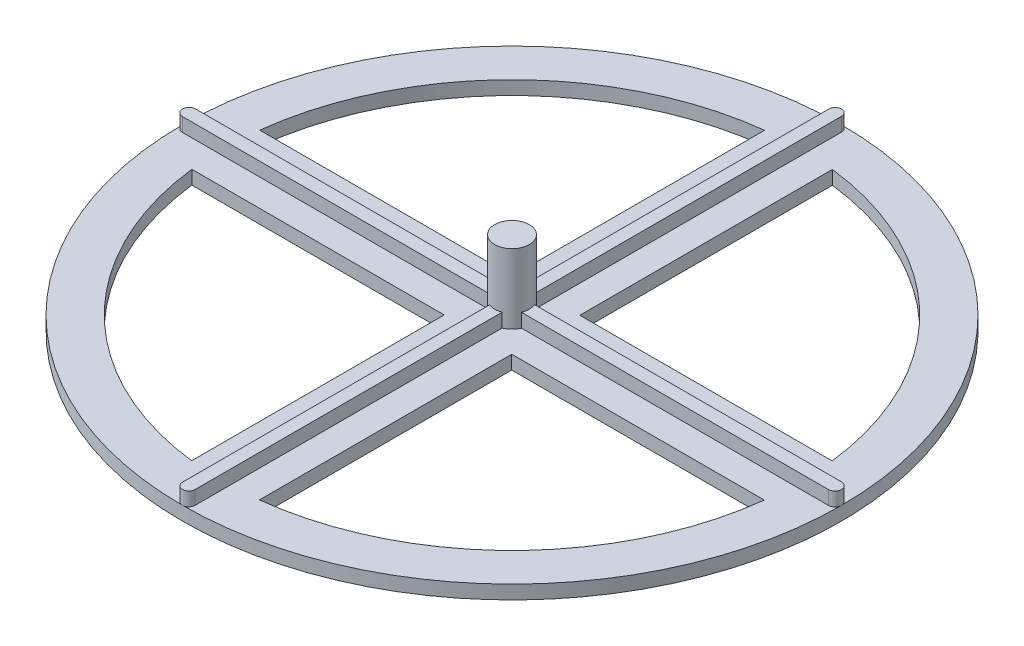
ISO-10303-21;
HEADER;
FILE_DESCRIPTION(('STEP AP214'),'2;1');
FILE_NAME('part.step','',(''),(''),'','','');
FILE_SCHEMA(('AUTOMOTIVE_DESIGN { 1 0 10303 214 1 1 1 1 }'));
ENDSEC;
DATA;
#1=APPLICATION_CONTEXT('core data for automotive mechanical design processes');
#2=APPLICATION_PROTOCOL_DEFINITION('international standard','automotive_design',2000,#1);
#3=PRODUCT_CONTEXT('',#1,'mechanical');
#4=PRODUCT('Part','Part','',(#3));
#5=PRODUCT_RELATED_PRODUCT_CATEGORY('part','',(#4));
#6=PRODUCT_DEFINITION_FORMATION('','',#4);
#7=PRODUCT_DEFINITION_CONTEXT('part definition',#1,'design');
#8=PRODUCT_DEFINITION('design','',#6,#7);
#9=PRODUCT_DEFINITION_SHAPE('','',#8);
#10=(LENGTH_UNIT() NAMED_UNIT(*) SI_UNIT(.MILLI.,.METRE.));
#11=(NAMED_UNIT(*) PLANE_ANGLE_UNIT() SI_UNIT($,.RADIAN.));
#12=(NAMED_UNIT(*) SI_UNIT($,.STERADIAN.) SOLID_ANGLE_UNIT());
#13=UNCERTAINTY_MEASURE_WITH_UNIT(LENGTH_MEASURE(1.E-05),#10,'distance_accuracy_value','');
#14=(GEOMETRIC_REPRESENTATION_CONTEXT(3) GLOBAL_UNCERTAINTY_ASSIGNED_CONTEXT((#13)) GLOBAL_UNIT_ASSIGNED_CONTEXT((#10,
#11,#12)) REPRESENTATION_CONTEXT('',''));
#15=CARTESIAN_POINT('',(0.,0.,0.));
#16=DIRECTION('',(0.,0.,1.));
#17=DIRECTION('',(1.,0.,0.));
#18=AXIS2_PLACEMENT_3D('',#15,#16,#17);
#19=CARTESIAN_POINT('',(0.,6.35,-74.7395));
#20=DIRECTION('',(0.,1.,0.));
#21=DIRECTION('',(0.,0.,1.));
#22=AXIS2_PLACEMENT_3D('',#19,#20,#21);
#23=PLANE('',#22);
#24=CARTESIAN_POINT('',(0.,6.35,0.));
#25=DIRECTION('',(0.,1.,0.));
#26=DIRECTION('',(0.,0.,1.));
#27=AXIS2_PLACEMENT_3D('',#24,#25,#26);
#28=CIRCLE('',#27,4.);
#29=CARTESIAN_POINT('',(3.69830015006894,6.35,1.524));
#30=VERTEX_POINT('',#29);
#31=CARTESIAN_POINT('',(3.69830015006894,6.35,-1.524));
#32=VERTEX_POINT('',#31);
#33=EDGE_CURVE('E415',#30,#32,#28,.T.);
#34=ORIENTED_EDGE('',*,*,#33,.F.);
#35=DIRECTION('',(1.,0.,0.));
#36=VECTOR('',#35,1.);
#37=CARTESIAN_POINT('',(-74.676,6.35,1.524));
#38=LINE('',#37,#36);
#39=CARTESIAN_POINT('',(74.676,6.35,1.524));
#40=VERTEX_POINT('',#39);
#41=EDGE_CURVE('E509',#30,#40,#38,.T.);
#42=ORIENTED_EDGE('',*,*,#41,.T.);
#43=CARTESIAN_POINT('',(74.676,6.35,0.));
#44=DIRECTION('',(0.,1.,0.));
#45=DIRECTION('',(0.,0.,1.));
#46=AXIS2_PLACEMENT_3D('',#43,#44,#45);
#47=CIRCLE('',#46,1.524);
#48=CARTESIAN_POINT('',(74.676,6.35,-1.524));
#49=VERTEX_POINT('',#48);
#50=EDGE_CURVE('E497',#40,#49,#47,.T.);
#51=ORIENTED_EDGE('',*,*,#50,.T.);
#52=DIRECTION('',(1.,0.,0.));
#53=VECTOR('',#52,1.);
#54=CARTESIAN_POINT('',(-74.676,6.35,-1.524));
#55=LINE('',#54,#53);
#56=EDGE_CURVE('E501',#32,#49,#55,.T.);
#57=ORIENTED_EDGE('',*,*,#56,.F.);
#58=EDGE_LOOP('',(#34,#42,#51,#57));
#59=FACE_BOUND('',#58,.T.);
#60=ADVANCED_FACE('F69',(#59),#23,.T.);
#61=CARTESIAN_POINT('',(1.46050000000002,6.35,-3.72383401214393));
#62=VERTEX_POINT('',#61);
#63=CARTESIAN_POINT('',(-1.46049999999998,6.35,-3.72383401214394));
#64=VERTEX_POINT('',#63);
#65=EDGE_CURVE('E414',#62,#64,#28,.T.);
#66=ORIENTED_EDGE('',*,*,#65,.F.);
#67=DIRECTION('',(0.,0.,1.));
#68=VECTOR('',#67,1.);
#69=CARTESIAN_POINT('',(1.46050000000002,6.35,-74.7395));
#70=LINE('',#69,#68);
#71=CARTESIAN_POINT('',(1.46050000000002,6.35,-74.7395));
#72=VERTEX_POINT('',#71);
#73=EDGE_CURVE('E456',#72,#62,#70,.T.);
#74=ORIENTED_EDGE('',*,*,#73,.F.);
#75=CARTESIAN_POINT('',(0.,6.35,-74.7395));
#76=DIRECTION('',(0.,1.,0.));
#77=DIRECTION('',(0.,0.,1.));
#78=AXIS2_PLACEMENT_3D('',#75,#76,#77);
#79=CIRCLE('',#78,1.4605);
#80=CARTESIAN_POINT('',(-1.46049999999998,6.35,-74.7395));
#81=VERTEX_POINT('',#80);
#82=EDGE_CURVE('E441',#72,#81,#79,.T.);
#83=ORIENTED_EDGE('',*,*,#82,.T.);
#84=DIRECTION('',(0.,0.,1.));
#85=VECTOR('',#84,1.);
#86=CARTESIAN_POINT('',(-1.46049999999998,6.35,-74.7395));
#87=LINE('',#86,#85);
#88=EDGE_CURVE('E447',#81,#64,#87,.T.);
#89=ORIENTED_EDGE('',*,*,#88,.T.);
#90=EDGE_LOOP('',(#66,#74,#83,#89));
#91=FACE_BOUND('',#90,.T.);
#92=ADVANCED_FACE('F614',(#91),#23,.T.);
#93=CARTESIAN_POINT('',(-3.69830015006895,6.35,-1.524));
#94=VERTEX_POINT('',#93);
#95=CARTESIAN_POINT('',(-3.69830015006894,6.35,1.524));
#96=VERTEX_POINT('',#95);
#97=EDGE_CURVE('E408',#94,#96,#28,.T.);
#98=ORIENTED_EDGE('',*,*,#97,.F.);
#99=CARTESIAN_POINT('',(-74.676,6.35,-1.524));
#100=VERTEX_POINT('',#99);
#101=EDGE_CURVE('E503',#100,#94,#55,.T.);
#102=ORIENTED_EDGE('',*,*,#101,.F.);
#103=CARTESIAN_POINT('',(-74.676,6.35,0.));
#104=DIRECTION('',(0.,1.,0.));
#105=DIRECTION('',(0.,0.,1.));
#106=AXIS2_PLACEMENT_3D('',#103,#104,#105);
#107=CIRCLE('',#106,1.524);
#108=CARTESIAN_POINT('',(-74.676,6.35,1.524));
#109=VERTEX_POINT('',#108);
#110=EDGE_CURVE('E506',#100,#109,#107,.T.);
#111=ORIENTED_EDGE('',*,*,#110,.T.);
#112=EDGE_CURVE('E510',#109,#96,#38,.T.);
#113=ORIENTED_EDGE('',*,*,#112,.T.);
#114=EDGE_LOOP('',(#98,#102,#111,#113));
#115=FACE_BOUND('',#114,.T.);
#116=ADVANCED_FACE('F626',(#115),#23,.T.);
#117=CARTESIAN_POINT('',(0.,3.175,0.));
#118=DIRECTION('',(0.,1.,0.));
#119=DIRECTION('',(0.,0.,1.));
#120=AXIS2_PLACEMENT_3D('',#117,#118,#119);
#121=PLANE('',#120);
#122=DIRECTION('',(-1.,0.,0.));
#123=VECTOR('',#122,1.);
#124=CARTESIAN_POINT('',(7.81049999999993,3.175,7.87400000000005));
#125=LINE('',#124,#123);
#126=CARTESIAN_POINT('',(66.2084265709433,3.175,7.87400000000045));
#127=VERTEX_POINT('',#126);
#128=CARTESIAN_POINT('',(7.81049999999993,3.175,7.87400000000005));
#129=VERTEX_POINT('',#128);
#130=EDGE_CURVE('E85',#127,#129,#125,.T.);
#131=ORIENTED_EDGE('',*,*,#130,.F.);
#132=CARTESIAN_POINT('',(0.,3.175,0.));
#133=DIRECTION('',(0.,1.,0.));
#134=DIRECTION('',(0.,0.,1.));
#135=AXIS2_PLACEMENT_3D('',#132,#133,#134);
#136=CIRCLE('',#135,66.675);
#137=CARTESIAN_POINT('',(7.81049999999952,3.175,66.2159475862877));
#138=VERTEX_POINT('',#137);
#139=EDGE_CURVE('E317',#138,#127,#136,.T.);
#140=ORIENTED_EDGE('',*,*,#139,.F.);
#141=DIRECTION('',(0.,0.,1.));
#142=VECTOR('',#141,1.);
#143=CARTESIAN_POINT('',(7.81049999999955,3.175,63.0178235878549));
#144=LINE('',#143,#142);
#145=EDGE_CURVE('E322',#129,#138,#144,.T.);
#146=ORIENTED_EDGE('',*,*,#145,.F.);
#147=EDGE_LOOP('',(#131,#140,#146));
#148=FACE_BOUND('',#147,.T.);
#149=CARTESIAN_POINT('',(0.,3.175,0.));
#150=DIRECTION('',(0.,1.,0.));
#151=DIRECTION('',(0.,0.,1.));
#152=AXIS2_PLACEMENT_3D('',#149,#150,#151);
#153=CIRCLE('',#152,4.);
#154=CARTESIAN_POINT('',(3.69830015006894,3.175,1.524));
#155=VERTEX_POINT('',#154);
#156=CARTESIAN_POINT('',(1.46050000000002,3.175,3.72383401214393));
#157=VERTEX_POINT('',#156);
#158=EDGE_CURVE('E404',#155,#157,#153,.F.);
#159=ORIENTED_EDGE('',*,*,#158,.T.);
#160=DIRECTION('',(0.,0.,1.));
#161=VECTOR('',#160,1.);
#162=CARTESIAN_POINT('',(1.46050000000002,3.175,-74.7395));
#163=LINE('',#162,#161);
#164=CARTESIAN_POINT('',(1.46050000000002,3.175,74.7395));
#165=VERTEX_POINT('',#164);
#166=EDGE_CURVE('E476',#157,#165,#163,.T.);
#167=ORIENTED_EDGE('',*,*,#166,.T.);
#168=CARTESIAN_POINT('',(0.,3.175,74.7395));
#169=DIRECTION('',(0.,1.,0.));
#170=DIRECTION('',(0.,0.,1.));
#171=AXIS2_PLACEMENT_3D('',#168,#169,#170);
#172=CIRCLE('',#171,1.4605);
#173=CARTESIAN_POINT('',(0.,3.175,76.2));
#174=VERTEX_POINT('',#173);
#175=EDGE_CURVE('E477',#174,#165,#172,.T.);
#176=ORIENTED_EDGE('',*,*,#175,.F.);
#177=CARTESIAN_POINT('',(0.,3.175,0.));
#178=DIRECTION('',(0.,1.,0.));
#179=DIRECTION('',(0.,0.,1.));
#180=AXIS2_PLACEMENT_3D('',#177,#178,#179);
#181=CIRCLE('',#180,76.2);
#182=CARTESIAN_POINT('',(76.2,3.175,0.));
#183=VERTEX_POINT('',#182);
#184=EDGE_CURVE('E546',#174,#183,#181,.T.);
#185=ORIENTED_EDGE('',*,*,#184,.T.);
#186=CARTESIAN_POINT('',(74.676,3.175,0.));
#187=DIRECTION('',(0.,1.,0.));
#188=DIRECTION('',(0.,0.,1.));
#189=AXIS2_PLACEMENT_3D('',#186,#187,#188);
#190=CIRCLE('',#189,1.524);
#191=CARTESIAN_POINT('',(74.676,3.175,1.524));
#192=VERTEX_POINT('',#191);
#193=EDGE_CURVE('E440',#192,#183,#190,.T.);
#194=ORIENTED_EDGE('',*,*,#193,.F.);
#195=DIRECTION('',(1.,0.,0.));
#196=VECTOR('',#195,1.);
#197=CARTESIAN_POINT('',(-74.676,3.175,1.524));
#198=LINE('',#197,#196);
#199=EDGE_CURVE('E527',#155,#192,#198,.T.);
#200=ORIENTED_EDGE('',*,*,#199,.F.);
#201=EDGE_LOOP('',(#159,#167,#176,#185,#194,#200));
#202=FACE_BOUND('',#201,.T.);
#203=ADVANCED_FACE('F595',(#148,#202),#121,.T.);
#204=DIRECTION('',(0.,0.,1.));
#205=VECTOR('',#204,1.);
#206=CARTESIAN_POINT('',(7.87400000000003,3.175,-7.81049999999996));
#207=LINE('',#206,#205);
#208=CARTESIAN_POINT('',(7.87400000000022,3.175,-66.2084265709433));
#209=VERTEX_POINT('',#208);
#210=CARTESIAN_POINT('',(7.87400000000003,3.175,-7.81049999999996));
#211=VERTEX_POINT('',#210);
#212=EDGE_CURVE('E93',#209,#211,#207,.T.);
#213=ORIENTED_EDGE('',*,*,#212,.F.);
#214=CARTESIAN_POINT('',(0.,3.175,0.));
#215=DIRECTION('',(0.,1.,0.));
#216=DIRECTION('',(0.,0.,1.));
#217=AXIS2_PLACEMENT_3D('',#214,#215,#216);
#218=CIRCLE('',#217,66.675);
#219=CARTESIAN_POINT('',(66.2159475862878,3.175,-7.81049999999976));
#220=VERTEX_POINT('',#219);
#221=EDGE_CURVE('E277',#220,#209,#218,.T.);
#222=ORIENTED_EDGE('',*,*,#221,.F.);
#223=DIRECTION('',(1.,0.,0.));
#224=VECTOR('',#223,1.);
#225=CARTESIAN_POINT('',(63.0178235878549,3.175,-7.81049999999976));
#226=LINE('',#225,#224);
#227=EDGE_CURVE('E284',#211,#220,#226,.T.);
#228=ORIENTED_EDGE('',*,*,#227,.F.);
#229=EDGE_LOOP('',(#213,#222,#228));
#230=FACE_BOUND('',#229,.T.);
#231=CARTESIAN_POINT('',(1.46050000000002,3.175,-3.72383401214393));
#232=VERTEX_POINT('',#231);
#233=CARTESIAN_POINT('',(3.69830015006894,3.175,-1.524));
#234=VERTEX_POINT('',#233);
#235=EDGE_CURVE('E581',#232,#234,#153,.F.);
#236=ORIENTED_EDGE('',*,*,#235,.T.);
#237=DIRECTION('',(1.,0.,0.));
#238=VECTOR('',#237,1.);
#239=CARTESIAN_POINT('',(-74.676,3.175,-1.524));
#240=LINE('',#239,#238);
#241=CARTESIAN_POINT('',(74.676,3.175,-1.524));
#242=VERTEX_POINT('',#241);
#243=EDGE_CURVE('E518',#234,#242,#240,.T.);
#244=ORIENTED_EDGE('',*,*,#243,.T.);
#245=EDGE_CURVE('E78',#183,#242,#190,.T.);
#246=ORIENTED_EDGE('',*,*,#245,.F.);
#247=CARTESIAN_POINT('',(0.,3.175,-76.2));
#248=VERTEX_POINT('',#247);
#249=EDGE_CURVE('E549',#183,#248,#181,.T.);
#250=ORIENTED_EDGE('',*,*,#249,.T.);
#251=CARTESIAN_POINT('',(0.,3.175,-74.7395));
#252=DIRECTION('',(0.,1.,0.));
#253=DIRECTION('',(0.,0.,1.));
#254=AXIS2_PLACEMENT_3D('',#251,#252,#253);
#255=CIRCLE('',#254,1.4605);
#256=CARTESIAN_POINT('',(1.46050000000002,3.175,-74.7395));
#257=VERTEX_POINT('',#256);
#258=EDGE_CURVE('E461',#257,#248,#255,.T.);
#259=ORIENTED_EDGE('',*,*,#258,.F.);
#260=EDGE_CURVE('E446',#257,#232,#163,.T.);
#261=ORIENTED_EDGE('',*,*,#260,.T.);
#262=EDGE_LOOP('',(#236,#244,#246,#250,#259,#261));
#263=FACE_BOUND('',#262,.T.);
#264=ADVANCED_FACE('F286',(#230,#263),#121,.T.);
#265=DIRECTION('',(0.,0.,-1.));
#266=VECTOR('',#265,1.);
#267=CARTESIAN_POINT('',(-7.87400000000008,3.175,7.8104999999999));
#268=LINE('',#267,#266);
#269=CARTESIAN_POINT('',(-7.87400000000069,3.175,66.2084265709433));
#270=VERTEX_POINT('',#269);
#271=CARTESIAN_POINT('',(-7.87400000000008,3.175,7.81049999999991));
#272=VERTEX_POINT('',#271);
#273=EDGE_CURVE('E347',#270,#272,#268,.T.);
#274=ORIENTED_EDGE('',*,*,#273,.F.);
#275=CARTESIAN_POINT('',(0.,3.175,0.));
#276=DIRECTION('',(0.,1.,0.));
#277=DIRECTION('',(0.,0.,1.));
#278=AXIS2_PLACEMENT_3D('',#275,#276,#277);
#279=CIRCLE('',#278,66.675);
#280=CARTESIAN_POINT('',(-66.2159475862877,3.175,7.81049999999926));
#281=VERTEX_POINT('',#280);
#282=EDGE_CURVE('E350',#281,#270,#279,.T.);
#283=ORIENTED_EDGE('',*,*,#282,.F.);
#284=DIRECTION('',(-1.,0.,0.));
#285=VECTOR('',#284,1.);
#286=CARTESIAN_POINT('',(-63.017823587855,3.175,7.81049999999932));
#287=LINE('',#286,#285);
#288=EDGE_CURVE('E314',#272,#281,#287,.T.);
#289=ORIENTED_EDGE('',*,*,#288,.F.);
#290=EDGE_LOOP('',(#274,#283,#289));
#291=FACE_BOUND('',#290,.T.);
#292=CARTESIAN_POINT('',(-1.46049999999998,3.175,3.72383401214395));
#293=VERTEX_POINT('',#292);
#294=CARTESIAN_POINT('',(-3.69830015006894,3.175,1.524));
#295=VERTEX_POINT('',#294);
#296=EDGE_CURVE('E405',#293,#295,#153,.F.);
#297=ORIENTED_EDGE('',*,*,#296,.T.);
#298=CARTESIAN_POINT('',(-74.676,3.175,1.524));
#299=VERTEX_POINT('',#298);
#300=EDGE_CURVE('E502',#299,#295,#198,.T.);
#301=ORIENTED_EDGE('',*,*,#300,.F.);
#302=CARTESIAN_POINT('',(-74.676,3.175,0.));
#303=DIRECTION('',(0.,1.,0.));
#304=DIRECTION('',(0.,0.,1.));
#305=AXIS2_PLACEMENT_3D('',#302,#303,#304);
#306=CIRCLE('',#305,1.524);
#307=CARTESIAN_POINT('',(-76.2,3.175,0.));
#308=VERTEX_POINT('',#307);
#309=EDGE_CURVE('E528',#308,#299,#306,.T.);
#310=ORIENTED_EDGE('',*,*,#309,.F.);
#311=EDGE_CURVE('E550',#308,#174,#181,.T.);
#312=ORIENTED_EDGE('',*,*,#311,.T.);
#313=CARTESIAN_POINT('',(-1.46049999999998,3.175,74.7395));
#314=VERTEX_POINT('',#313);
#315=EDGE_CURVE('E472',#314,#174,#172,.T.);
#316=ORIENTED_EDGE('',*,*,#315,.F.);
#317=DIRECTION('',(0.,0.,1.));
#318=VECTOR('',#317,1.);
#319=CARTESIAN_POINT('',(-1.46049999999998,3.175,-74.7395));
#320=LINE('',#319,#318);
#321=EDGE_CURVE('E465',#293,#314,#320,.T.);
#322=ORIENTED_EDGE('',*,*,#321,.F.);
#323=EDGE_LOOP('',(#297,#301,#310,#312,#316,#322));
#324=FACE_BOUND('',#323,.T.);
#325=ADVANCED_FACE('F632',(#291,#324),#121,.T.);
#326=CARTESIAN_POINT('',(0.,3.175,0.));
#327=DIRECTION('',(0.,-1.,0.));
#328=DIRECTION('',(0.,0.,-1.));
#329=AXIS2_PLACEMENT_3D('',#326,#327,#328);
#330=CYLINDRICAL_SURFACE('',#329,76.2);
#331=ORIENTED_EDGE('',*,*,#184,.F.);
#332=ORIENTED_EDGE('',*,*,#311,.F.);
#333=EDGE_CURVE('E557',#248,#308,#181,.T.);
#334=ORIENTED_EDGE('',*,*,#333,.F.);
#335=ORIENTED_EDGE('',*,*,#249,.F.);
#336=EDGE_LOOP('',(#331,#332,#334,#335));
#337=FACE_BOUND('',#336,.T.);
#338=CARTESIAN_POINT('',(0.,0.,0.));
#339=DIRECTION('',(0.,1.,0.));
#340=DIRECTION('',(0.,0.,1.));
#341=AXIS2_PLACEMENT_3D('',#338,#339,#340);
#342=CIRCLE('',#341,76.2);
#343=CARTESIAN_POINT('',(0.,0.,76.2));
#344=VERTEX_POINT('',#343);
#345=EDGE_CURVE('E496',#344,#344,#342,.T.);
#346=ORIENTED_EDGE('',*,*,#345,.T.);
#347=EDGE_LOOP('',(#346));
#348=FACE_BOUND('',#347,.T.);
#349=ADVANCED_FACE('F71',(#337,#348),#330,.T.);
#350=DIRECTION('',(1.,0.,0.));
#351=VECTOR('',#350,1.);
#352=CARTESIAN_POINT('',(-7.81049999999998,3.175,-7.874));
#353=LINE('',#352,#351);
#354=CARTESIAN_POINT('',(-66.2084265709434,3.175,-7.87399999999999));
#355=VERTEX_POINT('',#354);
#356=CARTESIAN_POINT('',(-7.81049999999998,3.175,-7.874));
#357=VERTEX_POINT('',#356);
#358=EDGE_CURVE('E373',#355,#357,#353,.T.);
#359=ORIENTED_EDGE('',*,*,#358,.F.);
#360=CARTESIAN_POINT('',(0.,3.175,0.));
#361=DIRECTION('',(0.,1.,0.));
#362=DIRECTION('',(0.,0.,1.));
#363=AXIS2_PLACEMENT_3D('',#360,#361,#362);
#364=CIRCLE('',#363,66.675);
#365=CARTESIAN_POINT('',(-7.81049999999996,3.175,-66.2159475862877));
#366=VERTEX_POINT('',#365);
#367=EDGE_CURVE('E385',#366,#355,#364,.T.);
#368=ORIENTED_EDGE('',*,*,#367,.F.);
#369=DIRECTION('',(0.,0.,-1.));
#370=VECTOR('',#369,1.);
#371=CARTESIAN_POINT('',(-7.81049999999998,3.175,-63.0178235878549));
#372=LINE('',#371,#370);
#373=EDGE_CURVE('E299',#357,#366,#372,.T.);
#374=ORIENTED_EDGE('',*,*,#373,.F.);
#375=EDGE_LOOP('',(#359,#368,#374));
#376=FACE_BOUND('',#375,.T.);
#377=CARTESIAN_POINT('',(-3.69830015006894,3.175,-1.524));
#378=VERTEX_POINT('',#377);
#379=CARTESIAN_POINT('',(-1.46049999999998,3.175,-3.72383401214395));
#380=VERTEX_POINT('',#379);
#381=EDGE_CURVE('E409',#378,#380,#153,.F.);
#382=ORIENTED_EDGE('',*,*,#381,.T.);
#383=CARTESIAN_POINT('',(-1.46049999999998,3.175,-74.7395));
#384=VERTEX_POINT('',#383);
#385=EDGE_CURVE('E468',#384,#380,#320,.T.);
#386=ORIENTED_EDGE('',*,*,#385,.F.);
#387=EDGE_CURVE('E467',#248,#384,#255,.T.);
#388=ORIENTED_EDGE('',*,*,#387,.F.);
#389=ORIENTED_EDGE('',*,*,#333,.T.);
#390=CARTESIAN_POINT('',(-74.676,3.175,-1.524));
#391=VERTEX_POINT('',#390);
#392=EDGE_CURVE('E523',#391,#308,#306,.T.);
#393=ORIENTED_EDGE('',*,*,#392,.F.);
#394=EDGE_CURVE('E519',#391,#378,#240,.T.);
#395=ORIENTED_EDGE('',*,*,#394,.T.);
#396=EDGE_LOOP('',(#382,#386,#388,#389,#393,#395));
#397=FACE_BOUND('',#396,.T.);
#398=ADVANCED_FACE('F617',(#376,#397),#121,.T.);
#399=CARTESIAN_POINT('',(0.,0.,0.));
#400=DIRECTION('',(0.,1.,0.));
#401=DIRECTION('',(0.,0.,1.));
#402=AXIS2_PLACEMENT_3D('',#399,#400,#401);
#403=PLANE('',#402);
#404=CARTESIAN_POINT('',(0.,0.,0.));
#405=DIRECTION('',(0.,1.,0.));
#406=DIRECTION('',(0.,0.,1.));
#407=AXIS2_PLACEMENT_3D('',#404,#405,#406);
#408=CIRCLE('',#407,66.675);
#409=CARTESIAN_POINT('',(-66.2159475862877,0.,7.81049999999929));
#410=VERTEX_POINT('',#409);
#411=CARTESIAN_POINT('',(-7.87400000000069,0.,66.2084265709433));
#412=VERTEX_POINT('',#411);
#413=EDGE_CURVE('E361',#410,#412,#408,.T.);
#414=ORIENTED_EDGE('',*,*,#413,.T.);
#415=DIRECTION('',(0.,0.,-1.));
#416=VECTOR('',#415,1.);
#417=CARTESIAN_POINT('',(-7.87400000000065,0.,63.0099208379124));
#418=LINE('',#417,#416);
#419=CARTESIAN_POINT('',(-7.87400000000008,0.,7.8104999999999));
#420=VERTEX_POINT('',#419);
#421=EDGE_CURVE('E339',#412,#420,#418,.T.);
#422=ORIENTED_EDGE('',*,*,#421,.T.);
#423=DIRECTION('',(-1.,0.,0.));
#424=VECTOR('',#423,1.);
#425=CARTESIAN_POINT('',(-7.87400000000008,0.,7.8104999999999));
#426=LINE('',#425,#424);
#427=EDGE_CURVE('E351',#420,#410,#426,.T.);
#428=ORIENTED_EDGE('',*,*,#427,.T.);
#429=EDGE_LOOP('',(#414,#422,#428));
#430=FACE_BOUND('',#429,.T.);
#431=CARTESIAN_POINT('',(0.,0.,0.));
#432=DIRECTION('',(0.,1.,0.));
#433=DIRECTION('',(0.,0.,1.));
#434=AXIS2_PLACEMENT_3D('',#431,#432,#433);
#435=CIRCLE('',#434,66.675);
#436=CARTESIAN_POINT('',(7.81049999999952,0.,66.2159475862877));
#437=VERTEX_POINT('',#436);
#438=CARTESIAN_POINT('',(66.2084265709433,0.,7.87400000000045));
#439=VERTEX_POINT('',#438);
#440=EDGE_CURVE('E329',#437,#439,#435,.T.);
#441=ORIENTED_EDGE('',*,*,#440,.T.);
#442=DIRECTION('',(-1.,0.,0.));
#443=VECTOR('',#442,1.);
#444=CARTESIAN_POINT('',(63.0099208379124,0.,7.87400000000043));
#445=LINE('',#444,#443);
#446=CARTESIAN_POINT('',(7.81049999999993,0.,7.87400000000005));
#447=VERTEX_POINT('',#446);
#448=EDGE_CURVE('E307',#439,#447,#445,.T.);
#449=ORIENTED_EDGE('',*,*,#448,.T.);
#450=DIRECTION('',(0.,0.,1.));
#451=VECTOR('',#450,1.);
#452=CARTESIAN_POINT('',(7.81049999999993,0.,7.87400000000005));
#453=LINE('',#452,#451);
#454=EDGE_CURVE('E318',#447,#437,#453,.T.);
#455=ORIENTED_EDGE('',*,*,#454,.T.);
#456=EDGE_LOOP('',(#441,#449,#455));
#457=FACE_BOUND('',#456,.T.);
#458=CARTESIAN_POINT('',(0.,0.,0.));
#459=DIRECTION('',(0.,1.,0.));
#460=DIRECTION('',(0.,0.,1.));
#461=AXIS2_PLACEMENT_3D('',#458,#459,#460);
#462=CIRCLE('',#461,66.675);
#463=CARTESIAN_POINT('',(66.2159475862878,0.,-7.81049999999975));
#464=VERTEX_POINT('',#463);
#465=CARTESIAN_POINT('',(7.87400000000022,0.,-66.2084265709433));
#466=VERTEX_POINT('',#465);
#467=EDGE_CURVE('E293',#464,#466,#462,.T.);
#468=ORIENTED_EDGE('',*,*,#467,.T.);
#469=DIRECTION('',(0.,0.,1.));
#470=VECTOR('',#469,1.);
#471=CARTESIAN_POINT('',(7.87400000000021,0.,-63.0099208379125));
#472=LINE('',#471,#470);
#473=CARTESIAN_POINT('',(7.87400000000003,0.,-7.81049999999996));
#474=VERTEX_POINT('',#473);
#475=EDGE_CURVE('E269',#466,#474,#472,.T.);
#476=ORIENTED_EDGE('',*,*,#475,.T.);
#477=DIRECTION('',(1.,0.,0.));
#478=VECTOR('',#477,1.);
#479=CARTESIAN_POINT('',(7.87400000000003,0.,-7.81049999999996));
#480=LINE('',#479,#478);
#481=EDGE_CURVE('E289',#474,#464,#480,.T.);
#482=ORIENTED_EDGE('',*,*,#481,.T.);
#483=EDGE_LOOP('',(#468,#476,#482));
#484=FACE_BOUND('',#483,.T.);
#485=CARTESIAN_POINT('',(0.,0.,0.));
#486=DIRECTION('',(0.,1.,0.));
#487=DIRECTION('',(0.,0.,1.));
#488=AXIS2_PLACEMENT_3D('',#485,#486,#487);
#489=CIRCLE('',#488,66.675);
#490=CARTESIAN_POINT('',(-7.81049999999998,0.,-66.2159475862877));
#491=VERTEX_POINT('',#490);
#492=CARTESIAN_POINT('',(-66.2084265709434,0.,-7.87399999999999));
#493=VERTEX_POINT('',#492);
#494=EDGE_CURVE('E372',#491,#493,#489,.T.);
#495=ORIENTED_EDGE('',*,*,#494,.T.);
#496=DIRECTION('',(1.,0.,0.));
#497=VECTOR('',#496,1.);
#498=CARTESIAN_POINT('',(-63.0099208379125,0.,-7.87399999999999));
#499=LINE('',#498,#497);
#500=CARTESIAN_POINT('',(-7.81049999999998,0.,-7.874));
#501=VERTEX_POINT('',#500);
#502=EDGE_CURVE('E377',#493,#501,#499,.T.);
#503=ORIENTED_EDGE('',*,*,#502,.T.);
#504=DIRECTION('',(0.,0.,-1.));
#505=VECTOR('',#504,1.);
#506=CARTESIAN_POINT('',(-7.81049999999998,0.,-7.874));
#507=LINE('',#506,#505);
#508=EDGE_CURVE('E368',#501,#491,#507,.T.);
#509=ORIENTED_EDGE('',*,*,#508,.T.);
#510=EDGE_LOOP('',(#495,#503,#509));
#511=FACE_BOUND('',#510,.T.);
#512=ORIENTED_EDGE('',*,*,#345,.F.);
#513=EDGE_LOOP('',(#512));
#514=FACE_BOUND('',#513,.T.);
#515=ADVANCED_FACE('F740',(#430,#457,#484,#511,#514),#403,.F.);
#516=CARTESIAN_POINT('',(-1.46049999999998,6.35,-74.7395));
#517=DIRECTION('',(1.,0.,0.));
#518=DIRECTION('',(0.,0.,-1.));
#519=AXIS2_PLACEMENT_3D('',#516,#517,#518);
#520=PLANE('',#519);
#521=CARTESIAN_POINT('',(-1.46049999999998,6.35,3.72383401214394));
#522=VERTEX_POINT('',#521);
#523=CARTESIAN_POINT('',(-1.46049999999998,6.35,74.7395));
#524=VERTEX_POINT('',#523);
#525=EDGE_CURVE('E445',#522,#524,#87,.T.);
#526=ORIENTED_EDGE('',*,*,#525,.F.);
#527=DIRECTION('',(0.,1.,0.));
#528=VECTOR('',#527,1.);
#529=CARTESIAN_POINT('',(-1.46049999999998,-8.13870849898476,3.72383401214394));
#530=LINE('',#529,#528);
#531=EDGE_CURVE('E430',#522,#293,#530,.F.);
#532=ORIENTED_EDGE('',*,*,#531,.T.);
#533=ORIENTED_EDGE('',*,*,#321,.T.);
#534=DIRECTION('',(0.,-1.,0.));
#535=VECTOR('',#534,1.);
#536=CARTESIAN_POINT('',(-1.46049999999998,6.35,74.7395));
#537=LINE('',#536,#535);
#538=EDGE_CURVE('E488',#524,#314,#537,.T.);
#539=ORIENTED_EDGE('',*,*,#538,.F.);
#540=EDGE_LOOP('',(#526,#532,#533,#539));
#541=FACE_BOUND('',#540,.T.);
#542=ADVANCED_FACE('F657',(#541),#520,.F.);
#543=CARTESIAN_POINT('',(0.,6.35,74.7395));
#544=DIRECTION('',(0.,-1.,0.));
#545=DIRECTION('',(0.,0.,-1.));
#546=AXIS2_PLACEMENT_3D('',#543,#544,#545);
#547=CYLINDRICAL_SURFACE('',#546,1.4605);
#548=ORIENTED_EDGE('',*,*,#315,.T.);
#549=ORIENTED_EDGE('',*,*,#175,.T.);
#550=DIRECTION('',(0.,-1.,0.));
#551=VECTOR('',#550,1.);
#552=CARTESIAN_POINT('',(1.46050000000002,6.35,74.7395));
#553=LINE('',#552,#551);
#554=CARTESIAN_POINT('',(1.46050000000002,6.35,74.7395));
#555=VERTEX_POINT('',#554);
#556=EDGE_CURVE('E484',#555,#165,#553,.T.);
#557=ORIENTED_EDGE('',*,*,#556,.F.);
#558=CARTESIAN_POINT('',(0.,6.35,74.7395));
#559=DIRECTION('',(0.,1.,0.));
#560=DIRECTION('',(0.,0.,1.));
#561=AXIS2_PLACEMENT_3D('',#558,#559,#560);
#562=CIRCLE('',#561,1.4605);
#563=EDGE_CURVE('E451',#524,#555,#562,.T.);
#564=ORIENTED_EDGE('',*,*,#563,.F.);
#565=ORIENTED_EDGE('',*,*,#538,.T.);
#566=EDGE_LOOP('',(#548,#549,#557,#564,#565));
#567=FACE_BOUND('',#566,.T.);
#568=ADVANCED_FACE('F655',(#567),#547,.T.);
#569=CARTESIAN_POINT('',(1.46050000000002,6.35,-74.7395));
#570=DIRECTION('',(1.,0.,0.));
#571=DIRECTION('',(0.,0.,-1.));
#572=AXIS2_PLACEMENT_3D('',#569,#570,#571);
#573=PLANE('',#572);
#574=DIRECTION('',(0.,1.,0.));
#575=VECTOR('',#574,1.);
#576=CARTESIAN_POINT('',(1.46050000000002,-8.13870849898476,3.72383401214393));
#577=LINE('',#576,#575);
#578=CARTESIAN_POINT('',(1.46050000000002,6.35,3.72383401214393));
#579=VERTEX_POINT('',#578);
#580=EDGE_CURVE('E426',#579,#157,#577,.F.);
#581=ORIENTED_EDGE('',*,*,#580,.F.);
#582=EDGE_CURVE('E455',#579,#555,#70,.T.);
#583=ORIENTED_EDGE('',*,*,#582,.T.);
#584=ORIENTED_EDGE('',*,*,#556,.T.);
#585=ORIENTED_EDGE('',*,*,#166,.F.);
#586=EDGE_LOOP('',(#581,#583,#584,#585));
#587=FACE_BOUND('',#586,.T.);
#588=ADVANCED_FACE('F600',(#587),#573,.T.);
#589=CARTESIAN_POINT('',(0.,6.35,-74.7395));
#590=DIRECTION('',(0.,-1.,0.));
#591=DIRECTION('',(0.,0.,-1.));
#592=AXIS2_PLACEMENT_3D('',#589,#590,#591);
#593=CYLINDRICAL_SURFACE('',#592,1.4605);
#594=ORIENTED_EDGE('',*,*,#258,.T.);
#595=ORIENTED_EDGE('',*,*,#387,.T.);
#596=DIRECTION('',(0.,-1.,0.));
#597=VECTOR('',#596,1.);
#598=CARTESIAN_POINT('',(-1.46049999999998,6.35,-74.7395));
#599=LINE('',#598,#597);
#600=EDGE_CURVE('E492',#81,#384,#599,.T.);
#601=ORIENTED_EDGE('',*,*,#600,.F.);
#602=ORIENTED_EDGE('',*,*,#82,.F.);
#603=DIRECTION('',(0.,-1.,0.));
#604=VECTOR('',#603,1.);
#605=CARTESIAN_POINT('',(1.46050000000002,6.35,-74.7395));
#606=LINE('',#605,#604);
#607=EDGE_CURVE('E460',#72,#257,#606,.T.);
#608=ORIENTED_EDGE('',*,*,#607,.T.);
#609=EDGE_LOOP('',(#594,#595,#601,#602,#608));
#610=FACE_BOUND('',#609,.T.);
#611=ADVANCED_FACE('F573',(#610),#593,.T.);
#612=ORIENTED_EDGE('',*,*,#385,.T.);
#613=DIRECTION('',(0.,1.,0.));
#614=VECTOR('',#613,1.);
#615=CARTESIAN_POINT('',(-1.46049999999998,-8.13870849898476,-3.72383401214394));
#616=LINE('',#615,#614);
#617=EDGE_CURVE('E437',#380,#64,#616,.T.);
#618=ORIENTED_EDGE('',*,*,#617,.T.);
#619=ORIENTED_EDGE('',*,*,#88,.F.);
#620=ORIENTED_EDGE('',*,*,#600,.T.);
#621=EDGE_LOOP('',(#612,#618,#619,#620));
#622=FACE_BOUND('',#621,.T.);
#623=ADVANCED_FACE('F616',(#622),#520,.F.);
#624=DIRECTION('',(0.,1.,0.));
#625=VECTOR('',#624,1.);
#626=CARTESIAN_POINT('',(1.46050000000002,-8.13870849898476,-3.72383401214393));
#627=LINE('',#626,#625);
#628=EDGE_CURVE('E433',#232,#62,#627,.T.);
#629=ORIENTED_EDGE('',*,*,#628,.F.);
#630=ORIENTED_EDGE('',*,*,#260,.F.);
#631=ORIENTED_EDGE('',*,*,#607,.F.);
#632=ORIENTED_EDGE('',*,*,#73,.T.);
#633=EDGE_LOOP('',(#629,#630,#631,#632));
#634=FACE_BOUND('',#633,.T.);
#635=ADVANCED_FACE('F579',(#634),#573,.T.);
#636=EDGE_CURVE('E425',#522,#579,#28,.T.);
#637=ORIENTED_EDGE('',*,*,#636,.F.);
#638=ORIENTED_EDGE('',*,*,#525,.T.);
#639=ORIENTED_EDGE('',*,*,#563,.T.);
#640=ORIENTED_EDGE('',*,*,#582,.F.);
#641=EDGE_LOOP('',(#637,#638,#639,#640));
#642=FACE_BOUND('',#641,.T.);
#643=ADVANCED_FACE('F660',(#642),#23,.T.);
#644=CARTESIAN_POINT('',(-74.676,6.35,1.524));
#645=DIRECTION('',(0.,0.,-1.));
#646=DIRECTION('',(-1.,0.,0.));
#647=AXIS2_PLACEMENT_3D('',#644,#645,#646);
#648=PLANE('',#647);
#649=ORIENTED_EDGE('',*,*,#41,.F.);
#650=DIRECTION('',(0.,1.,0.));
#651=VECTOR('',#650,1.);
#652=CARTESIAN_POINT('',(3.69830015006895,-8.13870849898476,1.524));
#653=LINE('',#652,#651);
#654=EDGE_CURVE('E422',#30,#155,#653,.F.);
#655=ORIENTED_EDGE('',*,*,#654,.T.);
#656=ORIENTED_EDGE('',*,*,#199,.T.);
#657=DIRECTION('',(0.,-1.,0.));
#658=VECTOR('',#657,1.);
#659=CARTESIAN_POINT('',(74.676,6.35,1.524));
#660=LINE('',#659,#658);
#661=EDGE_CURVE('E514',#40,#192,#660,.T.);
#662=ORIENTED_EDGE('',*,*,#661,.F.);
#663=EDGE_LOOP('',(#649,#655,#656,#662));
#664=FACE_BOUND('',#663,.T.);
#665=ADVANCED_FACE('F653',(#664),#648,.F.);
#666=CARTESIAN_POINT('',(74.676,6.35,0.));
#667=DIRECTION('',(0.,-1.,0.));
#668=DIRECTION('',(0.,0.,-1.));
#669=AXIS2_PLACEMENT_3D('',#666,#667,#668);
#670=CYLINDRICAL_SURFACE('',#669,1.524);
#671=ORIENTED_EDGE('',*,*,#193,.T.);
#672=ORIENTED_EDGE('',*,*,#245,.T.);
#673=DIRECTION('',(0.,-1.,0.));
#674=VECTOR('',#673,1.);
#675=CARTESIAN_POINT('',(74.676,6.35,-1.524));
#676=LINE('',#675,#674);
#677=EDGE_CURVE('E466',#49,#242,#676,.T.);
#678=ORIENTED_EDGE('',*,*,#677,.F.);
#679=ORIENTED_EDGE('',*,*,#50,.F.);
#680=ORIENTED_EDGE('',*,*,#661,.T.);
#681=EDGE_LOOP('',(#671,#672,#678,#679,#680));
#682=FACE_BOUND('',#681,.T.);
#683=ADVANCED_FACE('F644',(#682),#670,.T.);
#684=CARTESIAN_POINT('',(-74.676,6.35,-1.524));
#685=DIRECTION('',(0.,0.,-1.));
#686=DIRECTION('',(-1.,0.,0.));
#687=AXIS2_PLACEMENT_3D('',#684,#685,#686);
#688=PLANE('',#687);
#689=DIRECTION('',(0.,1.,0.));
#690=VECTOR('',#689,1.);
#691=CARTESIAN_POINT('',(3.69830015006895,-8.13870849898476,-1.524));
#692=LINE('',#691,#690);
#693=EDGE_CURVE('E418',#32,#234,#692,.F.);
#694=ORIENTED_EDGE('',*,*,#693,.F.);
#695=ORIENTED_EDGE('',*,*,#56,.T.);
#696=ORIENTED_EDGE('',*,*,#677,.T.);
#697=ORIENTED_EDGE('',*,*,#243,.F.);
#698=EDGE_LOOP('',(#694,#695,#696,#697));
#699=FACE_BOUND('',#698,.T.);
#700=ADVANCED_FACE('F647',(#699),#688,.T.);
#701=CARTESIAN_POINT('',(-74.676,6.35,0.));
#702=DIRECTION('',(0.,-1.,0.));
#703=DIRECTION('',(0.,0.,-1.));
#704=AXIS2_PLACEMENT_3D('',#701,#702,#703);
#705=CYLINDRICAL_SURFACE('',#704,1.524);
#706=ORIENTED_EDGE('',*,*,#392,.T.);
#707=ORIENTED_EDGE('',*,*,#309,.T.);
#708=DIRECTION('',(0.,-1.,0.));
#709=VECTOR('',#708,1.);
#710=CARTESIAN_POINT('',(-74.676,6.35,1.524));
#711=LINE('',#710,#709);
#712=EDGE_CURVE('E535',#109,#299,#711,.T.);
#713=ORIENTED_EDGE('',*,*,#712,.F.);
#714=ORIENTED_EDGE('',*,*,#110,.F.);
#715=DIRECTION('',(0.,-1.,0.));
#716=VECTOR('',#715,1.);
#717=CARTESIAN_POINT('',(-74.676,6.35,-1.524));
#718=LINE('',#717,#716);
#719=EDGE_CURVE('E539',#100,#391,#718,.T.);
#720=ORIENTED_EDGE('',*,*,#719,.T.);
#721=EDGE_LOOP('',(#706,#707,#713,#714,#720));
#722=FACE_BOUND('',#721,.T.);
#723=ADVANCED_FACE('F692',(#722),#705,.T.);
#724=ORIENTED_EDGE('',*,*,#300,.T.);
#725=DIRECTION('',(0.,1.,0.));
#726=VECTOR('',#725,1.);
#727=CARTESIAN_POINT('',(-3.69830015006895,-8.13870849898476,1.524));
#728=LINE('',#727,#726);
#729=EDGE_CURVE('E413',#295,#96,#728,.T.);
#730=ORIENTED_EDGE('',*,*,#729,.T.);
#731=ORIENTED_EDGE('',*,*,#112,.F.);
#732=ORIENTED_EDGE('',*,*,#712,.T.);
#733=EDGE_LOOP('',(#724,#730,#731,#732));
#734=FACE_BOUND('',#733,.T.);
#735=ADVANCED_FACE('F630',(#734),#648,.F.);
#736=DIRECTION('',(0.,1.,0.));
#737=VECTOR('',#736,1.);
#738=CARTESIAN_POINT('',(-3.69830015006895,-8.13870849898476,-1.524));
#739=LINE('',#738,#737);
#740=EDGE_CURVE('E12',#378,#94,#739,.T.);
#741=ORIENTED_EDGE('',*,*,#740,.F.);
#742=ORIENTED_EDGE('',*,*,#394,.F.);
#743=ORIENTED_EDGE('',*,*,#719,.F.);
#744=ORIENTED_EDGE('',*,*,#101,.T.);
#745=EDGE_LOOP('',(#741,#742,#743,#744));
#746=FACE_BOUND('',#745,.T.);
#747=ADVANCED_FACE('F622',(#746),#688,.T.);
#748=CARTESIAN_POINT('',(0.,-8.13870849898476,0.));
#749=DIRECTION('',(0.,1.,0.));
#750=DIRECTION('',(0.,0.,1.));
#751=AXIS2_PLACEMENT_3D('',#748,#749,#750);
#752=CYLINDRICAL_SURFACE('',#751,4.);
#753=CARTESIAN_POINT('',(0.,19.304,0.));
#754=DIRECTION('',(0.,1.,0.));
#755=DIRECTION('',(0.,0.,1.));
#756=AXIS2_PLACEMENT_3D('',#753,#754,#755);
#757=CIRCLE('',#756,4.);
#758=CARTESIAN_POINT('',(0.,19.304,4.));
#759=VERTEX_POINT('',#758);
#760=EDGE_CURVE('E395',#759,#759,#757,.T.);
#761=ORIENTED_EDGE('',*,*,#760,.F.);
#762=EDGE_LOOP('',(#761));
#763=FACE_BOUND('',#762,.T.);
#764=ORIENTED_EDGE('',*,*,#617,.F.);
#765=ORIENTED_EDGE('',*,*,#381,.F.);
#766=ORIENTED_EDGE('',*,*,#740,.T.);
#767=ORIENTED_EDGE('',*,*,#97,.T.);
#768=ORIENTED_EDGE('',*,*,#729,.F.);
#769=ORIENTED_EDGE('',*,*,#296,.F.);
#770=ORIENTED_EDGE('',*,*,#531,.F.);
#771=ORIENTED_EDGE('',*,*,#636,.T.);
#772=ORIENTED_EDGE('',*,*,#580,.T.);
#773=ORIENTED_EDGE('',*,*,#158,.F.);
#774=ORIENTED_EDGE('',*,*,#654,.F.);
#775=ORIENTED_EDGE('',*,*,#33,.T.);
#776=ORIENTED_EDGE('',*,*,#693,.T.);
#777=ORIENTED_EDGE('',*,*,#235,.F.);
#778=ORIENTED_EDGE('',*,*,#628,.T.);
#779=ORIENTED_EDGE('',*,*,#65,.T.);
#780=EDGE_LOOP('',(#764,#765,#766,#767,#768,#769,#770,#771,#772,#773,#774,#775,#776,#777,#778,#779));
#781=FACE_BOUND('',#780,.T.);
#782=ADVANCED_FACE('F585',(#763,#781),#752,.T.);
#783=CARTESIAN_POINT('',(0.,19.304,0.));
#784=DIRECTION('',(0.,1.,0.));
#785=DIRECTION('',(0.,0.,1.));
#786=AXIS2_PLACEMENT_3D('',#783,#784,#785);
#787=PLANE('',#786);
#788=ORIENTED_EDGE('',*,*,#760,.T.);
#789=EDGE_LOOP('',(#788));
#790=FACE_BOUND('',#789,.T.);
#791=ADVANCED_FACE('F827',(#790),#787,.T.);
#792=CARTESIAN_POINT('',(-7.81049999999998,0.,-7.874));
#793=DIRECTION('',(0.,0.,1.));
#794=DIRECTION('',(1.,0.,0.));
#795=AXIS2_PLACEMENT_3D('',#792,#793,#794);
#796=PLANE('',#795);
#797=ORIENTED_EDGE('',*,*,#358,.T.);
#798=DIRECTION('',(0.,1.,0.));
#799=VECTOR('',#798,1.);
#800=CARTESIAN_POINT('',(-7.81049999999998,0.,-7.874));
#801=LINE('',#800,#799);
#802=EDGE_CURVE('E391',#501,#357,#801,.T.);
#803=ORIENTED_EDGE('',*,*,#802,.F.);
#804=ORIENTED_EDGE('',*,*,#502,.F.);
#805=DIRECTION('',(0.,1.,0.));
#806=VECTOR('',#805,1.);
#807=CARTESIAN_POINT('',(-66.2084265709434,0.,-7.87399999999999));
#808=LINE('',#807,#806);
#809=EDGE_CURVE('E396',#493,#355,#808,.T.);
#810=ORIENTED_EDGE('',*,*,#809,.T.);
#811=EDGE_LOOP('',(#797,#803,#804,#810));
#812=FACE_BOUND('',#811,.T.);
#813=ADVANCED_FACE('F833',(#812),#796,.F.);
#814=CARTESIAN_POINT('',(0.,0.,0.));
#815=DIRECTION('',(0.,1.,0.));
#816=DIRECTION('',(0.,0.,1.));
#817=AXIS2_PLACEMENT_3D('',#814,#815,#816);
#818=CYLINDRICAL_SURFACE('',#817,66.675);
#819=ORIENTED_EDGE('',*,*,#367,.T.);
#820=ORIENTED_EDGE('',*,*,#809,.F.);
#821=ORIENTED_EDGE('',*,*,#494,.F.);
#822=DIRECTION('',(0.,1.,0.));
#823=VECTOR('',#822,1.);
#824=CARTESIAN_POINT('',(-7.81049999999996,0.,-66.2159475862877));
#825=LINE('',#824,#823);
#826=EDGE_CURVE('E381',#491,#366,#825,.T.);
#827=ORIENTED_EDGE('',*,*,#826,.T.);
#828=EDGE_LOOP('',(#819,#820,#821,#827));
#829=FACE_BOUND('',#828,.T.);
#830=ADVANCED_FACE('F846',(#829),#818,.F.);
#831=CARTESIAN_POINT('',(-7.81049999999998,0.,-63.0178235878549));
#832=DIRECTION('',(1.,0.,0.));
#833=DIRECTION('',(0.,0.,-1.));
#834=AXIS2_PLACEMENT_3D('',#831,#832,#833);
#835=PLANE('',#834);
#836=ORIENTED_EDGE('',*,*,#373,.T.);
#837=ORIENTED_EDGE('',*,*,#826,.F.);
#838=ORIENTED_EDGE('',*,*,#508,.F.);
#839=ORIENTED_EDGE('',*,*,#802,.T.);
#840=EDGE_LOOP('',(#836,#837,#838,#839));
#841=FACE_BOUND('',#840,.T.);
#842=ADVANCED_FACE('F862',(#841),#835,.F.);
#843=CARTESIAN_POINT('',(7.87400000000003,0.,-7.81049999999996));
#844=DIRECTION('',(-1.,0.,0.));
#845=DIRECTION('',(0.,0.,1.));
#846=AXIS2_PLACEMENT_3D('',#843,#844,#845);
#847=PLANE('',#846);
#848=ORIENTED_EDGE('',*,*,#212,.T.);
#849=DIRECTION('',(0.,1.,0.));
#850=VECTOR('',#849,1.);
#851=CARTESIAN_POINT('',(7.87400000000003,0.,-7.81049999999996));
#852=LINE('',#851,#850);
#853=EDGE_CURVE('E274',#474,#211,#852,.T.);
#854=ORIENTED_EDGE('',*,*,#853,.F.);
#855=ORIENTED_EDGE('',*,*,#475,.F.);
#856=DIRECTION('',(0.,1.,0.));
#857=VECTOR('',#856,1.);
#858=CARTESIAN_POINT('',(7.87400000000022,0.,-66.2084265709433));
#859=LINE('',#858,#857);
#860=EDGE_CURVE('E265',#466,#209,#859,.T.);
#861=ORIENTED_EDGE('',*,*,#860,.T.);
#862=EDGE_LOOP('',(#848,#854,#855,#861));
#863=FACE_BOUND('',#862,.T.);
#864=ADVANCED_FACE('F267',(#863),#847,.F.);
#865=CARTESIAN_POINT('',(0.,0.,0.));
#866=DIRECTION('',(0.,1.,0.));
#867=DIRECTION('',(0.,0.,1.));
#868=AXIS2_PLACEMENT_3D('',#865,#866,#867);
#869=CYLINDRICAL_SURFACE('',#868,66.675);
#870=ORIENTED_EDGE('',*,*,#221,.T.);
#871=ORIENTED_EDGE('',*,*,#860,.F.);
#872=ORIENTED_EDGE('',*,*,#467,.F.);
#873=DIRECTION('',(0.,1.,0.));
#874=VECTOR('',#873,1.);
#875=CARTESIAN_POINT('',(66.2159475862878,0.,-7.81049999999976));
#876=LINE('',#875,#874);
#877=EDGE_CURVE('E273',#464,#220,#876,.T.);
#878=ORIENTED_EDGE('',*,*,#877,.T.);
#879=EDGE_LOOP('',(#870,#871,#872,#878));
#880=FACE_BOUND('',#879,.T.);
#881=ADVANCED_FACE('F278',(#880),#869,.F.);
#882=CARTESIAN_POINT('',(63.0178235878549,0.,-7.81049999999976));
#883=DIRECTION('',(0.,0.,1.));
#884=DIRECTION('',(1.,0.,0.));
#885=AXIS2_PLACEMENT_3D('',#882,#883,#884);
#886=PLANE('',#885);
#887=ORIENTED_EDGE('',*,*,#227,.T.);
#888=ORIENTED_EDGE('',*,*,#877,.F.);
#889=ORIENTED_EDGE('',*,*,#481,.F.);
#890=ORIENTED_EDGE('',*,*,#853,.T.);
#891=EDGE_LOOP('',(#887,#888,#889,#890));
#892=FACE_BOUND('',#891,.T.);
#893=ADVANCED_FACE('F898',(#892),#886,.F.);
#894=CARTESIAN_POINT('',(7.81049999999993,0.,7.87400000000005));
#895=DIRECTION('',(0.,0.,-1.));
#896=DIRECTION('',(-1.,0.,0.));
#897=AXIS2_PLACEMENT_3D('',#894,#895,#896);
#898=PLANE('',#897);
#899=ORIENTED_EDGE('',*,*,#130,.T.);
#900=DIRECTION('',(0.,1.,0.));
#901=VECTOR('',#900,1.);
#902=CARTESIAN_POINT('',(7.81049999999993,0.,7.87400000000005));
#903=LINE('',#902,#901);
#904=EDGE_CURVE('E311',#447,#129,#903,.T.);
#905=ORIENTED_EDGE('',*,*,#904,.F.);
#906=ORIENTED_EDGE('',*,*,#448,.F.);
#907=DIRECTION('',(0.,1.,0.));
#908=VECTOR('',#907,1.);
#909=CARTESIAN_POINT('',(66.2084265709433,0.,7.87400000000045));
#910=LINE('',#909,#908);
#911=EDGE_CURVE('E308',#439,#127,#910,.T.);
#912=ORIENTED_EDGE('',*,*,#911,.T.);
#913=EDGE_LOOP('',(#899,#905,#906,#912));
#914=FACE_BOUND('',#913,.T.);
#915=ADVANCED_FACE('F907',(#914),#898,.F.);
#916=CARTESIAN_POINT('',(0.,0.,0.));
#917=DIRECTION('',(0.,1.,0.));
#918=DIRECTION('',(0.,0.,1.));
#919=AXIS2_PLACEMENT_3D('',#916,#917,#918);
#920=CYLINDRICAL_SURFACE('',#919,66.675);
#921=ORIENTED_EDGE('',*,*,#139,.T.);
#922=ORIENTED_EDGE('',*,*,#911,.F.);
#923=ORIENTED_EDGE('',*,*,#440,.F.);
#924=DIRECTION('',(0.,1.,0.));
#925=VECTOR('',#924,1.);
#926=CARTESIAN_POINT('',(7.81049999999952,0.,66.2159475862877));
#927=LINE('',#926,#925);
#928=EDGE_CURVE('E304',#437,#138,#927,.T.);
#929=ORIENTED_EDGE('',*,*,#928,.T.);
#930=EDGE_LOOP('',(#921,#922,#923,#929));
#931=FACE_BOUND('',#930,.T.);
#932=ADVANCED_FACE('F920',(#931),#920,.F.);
#933=CARTESIAN_POINT('',(7.81049999999955,0.,63.0178235878549));
#934=DIRECTION('',(-1.,0.,0.));
#935=DIRECTION('',(0.,0.,1.));
#936=AXIS2_PLACEMENT_3D('',#933,#934,#935);
#937=PLANE('',#936);
#938=ORIENTED_EDGE('',*,*,#145,.T.);
#939=ORIENTED_EDGE('',*,*,#928,.F.);
#940=ORIENTED_EDGE('',*,*,#454,.F.);
#941=ORIENTED_EDGE('',*,*,#904,.T.);
#942=EDGE_LOOP('',(#938,#939,#940,#941));
#943=FACE_BOUND('',#942,.T.);
#944=ADVANCED_FACE('F935',(#943),#937,.F.);
#945=CARTESIAN_POINT('',(-7.87400000000008,0.,7.8104999999999));
#946=DIRECTION('',(1.,0.,0.));
#947=DIRECTION('',(0.,0.,-1.));
#948=AXIS2_PLACEMENT_3D('',#945,#946,#947);
#949=PLANE('',#948);
#950=ORIENTED_EDGE('',*,*,#273,.T.);
#951=DIRECTION('',(0.,1.,0.));
#952=VECTOR('',#951,1.);
#953=CARTESIAN_POINT('',(-7.87400000000008,0.,7.8104999999999));
#954=LINE('',#953,#952);
#955=EDGE_CURVE('E343',#420,#272,#954,.T.);
#956=ORIENTED_EDGE('',*,*,#955,.F.);
#957=ORIENTED_EDGE('',*,*,#421,.F.);
#958=DIRECTION('',(0.,1.,0.));
#959=VECTOR('',#958,1.);
#960=CARTESIAN_POINT('',(-7.87400000000069,0.,66.2084265709433));
#961=LINE('',#960,#959);
#962=EDGE_CURVE('E340',#412,#270,#961,.T.);
#963=ORIENTED_EDGE('',*,*,#962,.T.);
#964=EDGE_LOOP('',(#950,#956,#957,#963));
#965=FACE_BOUND('',#964,.T.);
#966=ADVANCED_FACE('F945',(#965),#949,.F.);
#967=CARTESIAN_POINT('',(0.,0.,0.));
#968=DIRECTION('',(0.,1.,0.));
#969=DIRECTION('',(0.,0.,1.));
#970=AXIS2_PLACEMENT_3D('',#967,#968,#969);
#971=CYLINDRICAL_SURFACE('',#970,66.675);
#972=ORIENTED_EDGE('',*,*,#282,.T.);
#973=ORIENTED_EDGE('',*,*,#962,.F.);
#974=ORIENTED_EDGE('',*,*,#413,.F.);
#975=DIRECTION('',(0.,1.,0.));
#976=VECTOR('',#975,1.);
#977=CARTESIAN_POINT('',(-66.2159475862877,0.,7.81049999999926));
#978=LINE('',#977,#976);
#979=EDGE_CURVE('E336',#410,#281,#978,.T.);
#980=ORIENTED_EDGE('',*,*,#979,.T.);
#981=EDGE_LOOP('',(#972,#973,#974,#980));
#982=FACE_BOUND('',#981,.T.);
#983=ADVANCED_FACE('F958',(#982),#971,.F.);
#984=CARTESIAN_POINT('',(-63.017823587855,0.,7.81049999999932));
#985=DIRECTION('',(0.,0.,-1.));
#986=DIRECTION('',(-1.,0.,0.));
#987=AXIS2_PLACEMENT_3D('',#984,#985,#986);
#988=PLANE('',#987);
#989=ORIENTED_EDGE('',*,*,#288,.T.);
#990=ORIENTED_EDGE('',*,*,#979,.F.);
#991=ORIENTED_EDGE('',*,*,#427,.F.);
#992=ORIENTED_EDGE('',*,*,#955,.T.);
#993=EDGE_LOOP('',(#989,#990,#991,#992));
#994=FACE_BOUND('',#993,.T.);
#995=ADVANCED_FACE('F974',(#994),#988,.F.);
#996=CLOSED_SHELL('',(#60,#92,#116,#203,#264,#325,#349,#398,#515,#542,#568,#588,#611,#623,#635,
#643,#665,#683,#700,#723,#735,#747,#782,#791,#813,#830,#842,#864,#881,#893,#915,#932,#944,#966,
#983,#995));
#997=MANIFOLD_SOLID_BREP('B2',#996);
#998=ADVANCED_BREP_SHAPE_REPRESENTATION('',(#18,#997),#14);
#999=SHAPE_DEFINITION_REPRESENTATION(#9,#998);
ENDSEC;
END-ISO-10303-21;
